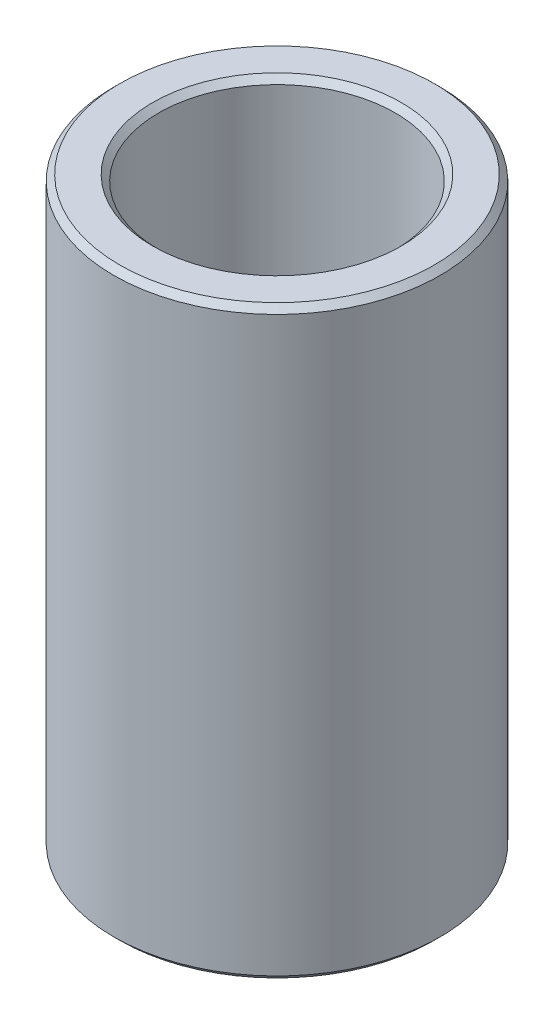
ISO-10303-21;
HEADER;
FILE_DESCRIPTION(('STEP AP214'),'2;1');
FILE_NAME('part.step','',(''),(''),'','','');
FILE_SCHEMA(('AUTOMOTIVE_DESIGN { 1 0 10303 214 1 1 1 1 }'));
ENDSEC;
DATA;
#1=APPLICATION_CONTEXT('core data for automotive mechanical design processes');
#2=APPLICATION_PROTOCOL_DEFINITION('international standard','automotive_design',2000,#1);
#3=PRODUCT_CONTEXT('',#1,'mechanical');
#4=PRODUCT('Part','Part','',(#3));
#5=PRODUCT_RELATED_PRODUCT_CATEGORY('part','',(#4));
#6=PRODUCT_DEFINITION_FORMATION('','',#4);
#7=PRODUCT_DEFINITION_CONTEXT('part definition',#1,'design');
#8=PRODUCT_DEFINITION('design','',#6,#7);
#9=PRODUCT_DEFINITION_SHAPE('','',#8);
#10=(LENGTH_UNIT() NAMED_UNIT(*) SI_UNIT(.MILLI.,.METRE.));
#11=(NAMED_UNIT(*) PLANE_ANGLE_UNIT() SI_UNIT($,.RADIAN.));
#12=(NAMED_UNIT(*) SI_UNIT($,.STERADIAN.) SOLID_ANGLE_UNIT());
#13=UNCERTAINTY_MEASURE_WITH_UNIT(LENGTH_MEASURE(1.E-05),#10,'distance_accuracy_value','');
#14=(GEOMETRIC_REPRESENTATION_CONTEXT(3) GLOBAL_UNCERTAINTY_ASSIGNED_CONTEXT((#13)) GLOBAL_UNIT_ASSIGNED_CONTEXT((#10,
#11,#12)) REPRESENTATION_CONTEXT('',''));
#15=CARTESIAN_POINT('',(0.,0.,0.));
#16=DIRECTION('',(0.,0.,1.));
#17=DIRECTION('',(1.,0.,0.));
#18=AXIS2_PLACEMENT_3D('',#15,#16,#17);
#19=CARTESIAN_POINT('',(0.,89.5943140631655,0.));
#20=DIRECTION('',(0.,-1.,0.));
#21=DIRECTION('',(0.,0.,-1.));
#22=AXIS2_PLACEMENT_3D('',#19,#20,#21);
#23=CYLINDRICAL_SURFACE('',#22,25.);
#24=CARTESIAN_POINT('',(0.,0.918779767942621,0.));
#25=DIRECTION('',(0.,1.,0.));
#26=DIRECTION('',(0.,0.,1.));
#27=AXIS2_PLACEMENT_3D('',#24,#25,#26);
#28=CIRCLE('',#27,25.);
#29=CARTESIAN_POINT('',(0.,0.918779767942621,25.));
#30=VERTEX_POINT('',#29);
#31=EDGE_CURVE('E10',#30,#30,#28,.T.);
#32=ORIENTED_EDGE('',*,*,#31,.T.);
#33=EDGE_LOOP('',(#32));
#34=FACE_BOUND('',#33,.T.);
#35=CARTESIAN_POINT('',(0.,88.6755342952229,0.));
#36=DIRECTION('',(0.,1.,0.));
#37=DIRECTION('',(0.,0.,1.));
#38=AXIS2_PLACEMENT_3D('',#35,#36,#37);
#39=CIRCLE('',#38,25.);
#40=CARTESIAN_POINT('',(0.,88.6755342952229,25.));
#41=VERTEX_POINT('',#40);
#42=EDGE_CURVE('E50',#41,#41,#39,.F.);
#43=ORIENTED_EDGE('',*,*,#42,.T.);
#44=EDGE_LOOP('',(#43));
#45=FACE_BOUND('',#44,.T.);
#46=ADVANCED_FACE('F39',(#34,#45),#23,.T.);
#47=CARTESIAN_POINT('',(0.,89.5943140631655,0.));
#48=DIRECTION('',(0.,1.,0.));
#49=DIRECTION('',(0.,0.,1.));
#50=AXIS2_PLACEMENT_3D('',#47,#48,#49);
#51=PLANE('',#50);
#52=CARTESIAN_POINT('',(0.,89.5943140631655,0.));
#53=DIRECTION('',(0.,1.,0.));
#54=DIRECTION('',(0.,0.,1.));
#55=AXIS2_PLACEMENT_3D('',#52,#53,#54);
#56=CIRCLE('',#55,19.0473556037687);
#57=CARTESIAN_POINT('',(0.,89.5943140631655,19.0473556037687));
#58=VERTEX_POINT('',#57);
#59=EDGE_CURVE('E58',#58,#58,#56,.F.);
#60=ORIENTED_EDGE('',*,*,#59,.T.);
#61=EDGE_LOOP('',(#60));
#62=FACE_BOUND('',#61,.T.);
#63=CARTESIAN_POINT('',(0.,89.5943140631655,0.));
#64=DIRECTION('',(0.,1.,0.));
#65=DIRECTION('',(0.,0.,1.));
#66=AXIS2_PLACEMENT_3D('',#63,#64,#65);
#67=CIRCLE('',#66,24.0812202320574);
#68=CARTESIAN_POINT('',(0.,89.5943140631655,24.0812202320574));
#69=VERTEX_POINT('',#68);
#70=EDGE_CURVE('E61',#69,#69,#67,.T.);
#71=ORIENTED_EDGE('',*,*,#70,.T.);
#72=EDGE_LOOP('',(#71));
#73=FACE_BOUND('',#72,.T.);
#74=ADVANCED_FACE('F88',(#62,#73),#51,.T.);
#75=CARTESIAN_POINT('',(0.,0.,0.));
#76=DIRECTION('',(0.,1.,0.));
#77=DIRECTION('',(0.,0.,1.));
#78=AXIS2_PLACEMENT_3D('',#75,#76,#77);
#79=PLANE('',#78);
#80=CARTESIAN_POINT('',(0.,0.,0.));
#81=DIRECTION('',(0.,1.,0.));
#82=DIRECTION('',(0.,0.,1.));
#83=AXIS2_PLACEMENT_3D('',#80,#81,#82);
#84=CIRCLE('',#83,19.0473556037687);
#85=CARTESIAN_POINT('',(0.,0.,19.0473556037687));
#86=VERTEX_POINT('',#85);
#87=EDGE_CURVE('E51',#86,#86,#84,.T.);
#88=ORIENTED_EDGE('',*,*,#87,.T.);
#89=EDGE_LOOP('',(#88));
#90=FACE_BOUND('',#89,.T.);
#91=CARTESIAN_POINT('',(0.,0.,0.));
#92=DIRECTION('',(0.,1.,0.));
#93=DIRECTION('',(0.,0.,1.));
#94=AXIS2_PLACEMENT_3D('',#91,#92,#93);
#95=CIRCLE('',#94,24.0812202320574);
#96=CARTESIAN_POINT('',(0.,0.,24.0812202320574));
#97=VERTEX_POINT('',#96);
#98=EDGE_CURVE('E54',#97,#97,#95,.F.);
#99=ORIENTED_EDGE('',*,*,#98,.T.);
#100=EDGE_LOOP('',(#99));
#101=FACE_BOUND('',#100,.T.);
#102=ADVANCED_FACE('F83',(#90,#101),#79,.F.);
#103=CARTESIAN_POINT('',(0.,89.5943140631655,0.));
#104=DIRECTION('',(0.,-1.,0.));
#105=DIRECTION('',(0.,0.,-1.));
#106=AXIS2_PLACEMENT_3D('',#103,#104,#105);
#107=CYLINDRICAL_SURFACE('',#106,18.1285758358261);
#108=CARTESIAN_POINT('',(0.,88.6755342952229,0.));
#109=DIRECTION('',(0.,1.,0.));
#110=DIRECTION('',(0.,0.,1.));
#111=AXIS2_PLACEMENT_3D('',#108,#109,#110);
#112=CIRCLE('',#111,18.1285758358261);
#113=CARTESIAN_POINT('',(0.,88.6755342952229,18.1285758358261));
#114=VERTEX_POINT('',#113);
#115=EDGE_CURVE('E67',#114,#114,#112,.T.);
#116=ORIENTED_EDGE('',*,*,#115,.T.);
#117=EDGE_LOOP('',(#116));
#118=FACE_BOUND('',#117,.T.);
#119=CARTESIAN_POINT('',(0.,0.918779767942607,0.));
#120=DIRECTION('',(0.,1.,0.));
#121=DIRECTION('',(0.,0.,1.));
#122=AXIS2_PLACEMENT_3D('',#119,#120,#121);
#123=CIRCLE('',#122,18.1285758358261);
#124=CARTESIAN_POINT('',(0.,0.918779767942607,18.1285758358261));
#125=VERTEX_POINT('',#124);
#126=EDGE_CURVE('E69',#125,#125,#123,.F.);
#127=ORIENTED_EDGE('',*,*,#126,.T.);
#128=EDGE_LOOP('',(#127));
#129=FACE_BOUND('',#128,.T.);
#130=ADVANCED_FACE('F71',(#118,#129),#107,.F.);
#131=CARTESIAN_POINT('',(0.,88.6755342952229,0.));
#132=DIRECTION('',(0.,1.,0.));
#133=DIRECTION('',(0.,0.,1.));
#134=AXIS2_PLACEMENT_3D('',#131,#132,#133);
#135=CONICAL_SURFACE('',#134,18.1285758358261,0.785398163397452);
#136=ORIENTED_EDGE('',*,*,#59,.F.);
#137=EDGE_LOOP('',(#136));
#138=FACE_BOUND('',#137,.T.);
#139=ORIENTED_EDGE('',*,*,#115,.F.);
#140=EDGE_LOOP('',(#139));
#141=FACE_BOUND('',#140,.T.);
#142=ADVANCED_FACE('F77',(#138,#141),#135,.F.);
#143=CARTESIAN_POINT('',(0.,0.,0.));
#144=DIRECTION('',(0.,-1.,0.));
#145=DIRECTION('',(0.,0.,-1.));
#146=AXIS2_PLACEMENT_3D('',#143,#144,#145);
#147=CONICAL_SURFACE('',#146,19.0473556037687,0.785398163397437);
#148=ORIENTED_EDGE('',*,*,#126,.F.);
#149=EDGE_LOOP('',(#148));
#150=FACE_BOUND('',#149,.T.);
#151=ORIENTED_EDGE('',*,*,#87,.F.);
#152=EDGE_LOOP('',(#151));
#153=FACE_BOUND('',#152,.T.);
#154=ADVANCED_FACE('F73',(#150,#153),#147,.F.);
#155=CARTESIAN_POINT('',(0.,0.918779767942621,0.));
#156=DIRECTION('',(0.,1.,0.));
#157=DIRECTION('',(0.,0.,1.));
#158=AXIS2_PLACEMENT_3D('',#155,#156,#157);
#159=CONICAL_SURFACE('',#158,25.,0.785398163397454);
#160=ORIENTED_EDGE('',*,*,#98,.F.);
#161=EDGE_LOOP('',(#160));
#162=FACE_BOUND('',#161,.T.);
#163=ORIENTED_EDGE('',*,*,#31,.F.);
#164=EDGE_LOOP('',(#163));
#165=FACE_BOUND('',#164,.T.);
#166=ADVANCED_FACE('F76',(#162,#165),#159,.T.);
#167=CARTESIAN_POINT('',(0.,89.5943140631655,0.));
#168=DIRECTION('',(0.,-1.,0.));
#169=DIRECTION('',(0.,0.,-1.));
#170=AXIS2_PLACEMENT_3D('',#167,#168,#169);
#171=CONICAL_SURFACE('',#170,24.0812202320574,0.785398163397437);
#172=ORIENTED_EDGE('',*,*,#42,.F.);
#173=EDGE_LOOP('',(#172));
#174=FACE_BOUND('',#173,.T.);
#175=ORIENTED_EDGE('',*,*,#70,.F.);
#176=EDGE_LOOP('',(#175));
#177=FACE_BOUND('',#176,.T.);
#178=ADVANCED_FACE('F45',(#174,#177),#171,.T.);
#179=CLOSED_SHELL('',(#46,#74,#102,#130,#142,#154,#166,#178));
#180=MANIFOLD_SOLID_BREP('B2',#179);
#181=ADVANCED_BREP_SHAPE_REPRESENTATION('',(#18,#180),#14);
#182=SHAPE_DEFINITION_REPRESENTATION(#9,#181);
ENDSEC;
END-ISO-10303-21;
